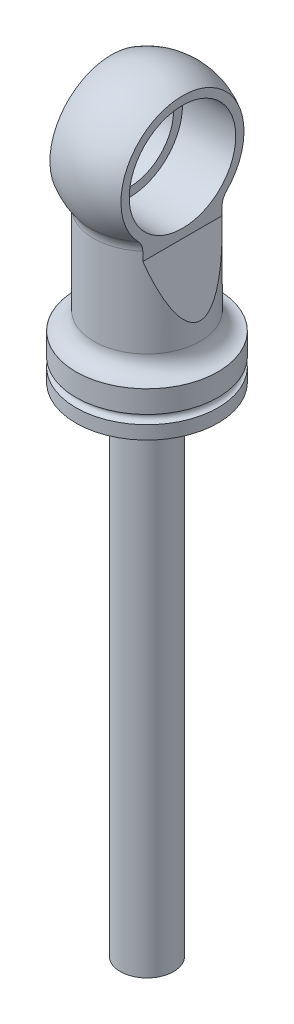
ISO-10303-21;
HEADER;
FILE_DESCRIPTION(('STEP AP214'),'2;1');
FILE_NAME('part.step','',(''),(''),'','','');
FILE_SCHEMA(('AUTOMOTIVE_DESIGN { 1 0 10303 214 1 1 1 1 }'));
ENDSEC;
DATA;
#1=APPLICATION_CONTEXT('core data for automotive mechanical design processes');
#2=APPLICATION_PROTOCOL_DEFINITION('international standard','automotive_design',2000,#1);
#3=PRODUCT_CONTEXT('',#1,'mechanical');
#4=PRODUCT('Part','Part','',(#3));
#5=PRODUCT_RELATED_PRODUCT_CATEGORY('part','',(#4));
#6=PRODUCT_DEFINITION_FORMATION('','',#4);
#7=PRODUCT_DEFINITION_CONTEXT('part definition',#1,'design');
#8=PRODUCT_DEFINITION('design','',#6,#7);
#9=PRODUCT_DEFINITION_SHAPE('','',#8);
#10=(LENGTH_UNIT() NAMED_UNIT(*) SI_UNIT(.MILLI.,.METRE.));
#11=(NAMED_UNIT(*) PLANE_ANGLE_UNIT() SI_UNIT($,.RADIAN.));
#12=(NAMED_UNIT(*) SI_UNIT($,.STERADIAN.) SOLID_ANGLE_UNIT());
#13=UNCERTAINTY_MEASURE_WITH_UNIT(LENGTH_MEASURE(1.E-05),#10,'distance_accuracy_value','');
#14=(GEOMETRIC_REPRESENTATION_CONTEXT(3) GLOBAL_UNCERTAINTY_ASSIGNED_CONTEXT((#13)) GLOBAL_UNIT_ASSIGNED_CONTEXT((#10,
#11,#12)) REPRESENTATION_CONTEXT('',''));
#15=CARTESIAN_POINT('',(0.,0.,0.));
#16=DIRECTION('',(0.,0.,1.));
#17=DIRECTION('',(1.,0.,0.));
#18=AXIS2_PLACEMENT_3D('',#15,#16,#17);
#19=CARTESIAN_POINT('',(-12.7,-36.5125,0.));
#20=DIRECTION('',(0.,-1.,0.));
#21=DIRECTION('',(0.,0.,-1.));
#22=AXIS2_PLACEMENT_3D('',#19,#20,#21);
#23=PLANE('',#22);
#24=CARTESIAN_POINT('',(0.,-36.5125,0.));
#25=DIRECTION('',(0.,1.,0.));
#26=DIRECTION('',(0.,0.,1.));
#27=AXIS2_PLACEMENT_3D('',#24,#25,#26);
#28=CIRCLE('',#27,12.7);
#29=CARTESIAN_POINT('',(0.,-36.5125,12.7));
#30=VERTEX_POINT('',#29);
#31=EDGE_CURVE('E187',#30,#30,#28,.T.);
#32=ORIENTED_EDGE('',*,*,#31,.F.);
#33=EDGE_LOOP('',(#32));
#34=FACE_BOUND('',#33,.T.);
#35=CARTESIAN_POINT('',(0.,-36.5125,0.));
#36=DIRECTION('',(0.,-1.,0.));
#37=DIRECTION('',(0.,0.,-1.));
#38=AXIS2_PLACEMENT_3D('',#35,#36,#37);
#39=CIRCLE('',#38,4.7625);
#40=CARTESIAN_POINT('',(0.,-36.5125,-4.7625));
#41=VERTEX_POINT('',#40);
#42=EDGE_CURVE('E128',#41,#41,#39,.T.);
#43=ORIENTED_EDGE('',*,*,#42,.F.);
#44=EDGE_LOOP('',(#43));
#45=FACE_BOUND('',#44,.T.);
#46=ADVANCED_FACE('F34',(#34,#45),#23,.T.);
#47=CARTESIAN_POINT('',(0.,0.,0.));
#48=DIRECTION('',(0.,1.,0.));
#49=DIRECTION('',(1.,0.,0.));
#50=AXIS2_PLACEMENT_3D('',#47,#48,#49);
#51=SPHERICAL_SURFACE('',#50,12.7);
#52=CARTESIAN_POINT('',(0.,-7.62542433254951,0.));
#53=DIRECTION('',(0.,1.,0.));
#54=DIRECTION('',(0.,0.,1.));
#55=AXIS2_PLACEMENT_3D('',#52,#53,#54);
#56=CIRCLE('',#55,10.1559294871795);
#57=CARTESIAN_POINT('',(6.35,-7.62542433254951,-7.92593235831355));
#58=VERTEX_POINT('',#57);
#59=CARTESIAN_POINT('',(-6.35,-7.62542433254951,-7.92593235831355));
#60=VERTEX_POINT('',#59);
#61=EDGE_CURVE('E186',#58,#60,#56,.T.);
#62=ORIENTED_EDGE('',*,*,#61,.T.);
#63=CARTESIAN_POINT('',(-6.35,0.,0.));
#64=DIRECTION('',(-1.,0.,0.));
#65=DIRECTION('',(0.,-1.,0.));
#66=AXIS2_PLACEMENT_3D('',#63,#64,#65);
#67=CIRCLE('',#66,10.9985226280624);
#68=CARTESIAN_POINT('',(-6.35,-7.62542433254951,7.92593235831355));
#69=VERTEX_POINT('',#68);
#70=EDGE_CURVE('E161',#60,#69,#67,.F.);
#71=ORIENTED_EDGE('',*,*,#70,.T.);
#72=CARTESIAN_POINT('',(6.35,-7.62542433254951,7.92593235831355));
#73=VERTEX_POINT('',#72);
#74=EDGE_CURVE('E183',#69,#73,#56,.T.);
#75=ORIENTED_EDGE('',*,*,#74,.T.);
#76=CARTESIAN_POINT('',(6.35,0.,0.));
#77=DIRECTION('',(1.,0.,0.));
#78=DIRECTION('',(0.,0.,-1.));
#79=AXIS2_PLACEMENT_3D('',#76,#77,#78);
#80=CIRCLE('',#79,10.9985226280624);
#81=EDGE_CURVE('E138',#73,#58,#80,.F.);
#82=ORIENTED_EDGE('',*,*,#81,.T.);
#83=EDGE_LOOP('',(#62,#71,#75,#82));
#84=FACE_BOUND('',#83,.T.);
#85=ADVANCED_FACE('F208',(#84),#51,.T.);
#86=CARTESIAN_POINT('',(0.,-9.5165295670218,0.));
#87=DIRECTION('',(0.,1.,0.));
#88=DIRECTION('',(0.,0.,1.));
#89=AXIS2_PLACEMENT_3D('',#86,#87,#88);
#90=TOROIDAL_SURFACE('',#89,12.6746,3.1496);
#91=CARTESIAN_POINT('',(0.,-9.51652956702179,0.));
#92=DIRECTION('',(0.,1.,0.));
#93=DIRECTION('',(0.,0.,1.));
#94=AXIS2_PLACEMENT_3D('',#91,#92,#93);
#95=CIRCLE('',#94,9.525);
#96=CARTESIAN_POINT('',(6.35,-9.51652956702179,-7.09951582856183));
#97=VERTEX_POINT('',#96);
#98=CARTESIAN_POINT('',(-6.35,-9.51652956702179,-7.09951582856182));
#99=VERTEX_POINT('',#98);
#100=EDGE_CURVE('E107',#97,#99,#95,.T.);
#101=ORIENTED_EDGE('',*,*,#100,.T.);
#102=CARTESIAN_POINT('',(-6.35,-7.84310383005062,-7.73332294756805));
#103=CARTESIAN_POINT('',(-6.35,-7.67425867062039,-7.87033894564403));
#104=CARTESIAN_POINT('',(-6.35,-7.51871969097066,-8.02395964662133));
#105=CARTESIAN_POINT('',(-6.35,-7.23566852278561,-8.35535431437894));
#106=CARTESIAN_POINT('',(-6.35,-7.10823380283425,-8.53319291011566));
#107=CARTESIAN_POINT('',(-6.35,-6.88315677802546,-8.90509723389965));
#108=CARTESIAN_POINT('',(-6.35,-6.78531878962239,-9.09904506653129));
#109=CARTESIAN_POINT('',(-6.35,-6.61931530429697,-9.49905219247618));
#110=CARTESIAN_POINT('',(-6.35,-6.55113262520225,-9.70510439379472));
#111=CARTESIAN_POINT('',(-6.35,-6.43869250593361,-10.1526633563205));
#112=CARTESIAN_POINT('',(-6.35,-6.39876184043421,-10.3952685812136));
#113=CARTESIAN_POINT('',(-6.35,-6.36077099477004,-10.8840806595856));
#114=CARTESIAN_POINT('',(-6.35,-6.36272983671395,-11.1302890985765));
#115=CARTESIAN_POINT('',(-6.35,-6.39846747391305,-11.4943592703766));
#116=CARTESIAN_POINT('',(-6.35,-6.41561648879375,-11.6140283018363));
#117=CARTESIAN_POINT('',(-6.35,-6.46078043382359,-11.851278180977));
#118=CARTESIAN_POINT('',(-6.35,-6.48878973464401,-11.9688600775382));
#119=CARTESIAN_POINT('',(-6.35,-6.55579819941596,-12.2008518022777));
#120=CARTESIAN_POINT('',(-6.35,-6.59479731533022,-12.3152616443188));
#121=CARTESIAN_POINT('',(-6.35,-6.6837823716992,-12.5396642320866));
#122=CARTESIAN_POINT('',(-6.35,-6.73376129473833,-12.6496597462343));
#123=CARTESIAN_POINT('',(-6.35,-6.83883363263572,-12.8528669668754));
#124=CARTESIAN_POINT('',(-6.35,-6.89285382435656,-12.9466341853112));
#125=CARTESIAN_POINT('',(-6.35,-7.00941071773218,-13.1286534181817));
#126=CARTESIAN_POINT('',(-6.35,-7.07194242323563,-13.2169086240897));
#127=CARTESIAN_POINT('',(-6.35,-7.20521925291905,-13.3869457150121));
#128=CARTESIAN_POINT('',(-6.35,-7.27596085196346,-13.4687303531542));
#129=CARTESIAN_POINT('',(-6.35,-7.4251846056352,-13.6248462837713));
#130=CARTESIAN_POINT('',(-6.35,-7.50366569904109,-13.699178595281));
#131=CARTESIAN_POINT('',(-6.35,-7.72980498269956,-13.8923661242834));
#132=CARTESIAN_POINT('',(-6.35,-7.88504037180109,-14.0025812013301));
#133=CARTESIAN_POINT('',(-6.35,-8.21322824809433,-14.1921017588644));
#134=CARTESIAN_POINT('',(-6.35,-8.38616844563738,-14.2714284989655));
#135=CARTESIAN_POINT('',(-6.35,-8.72723211608899,-14.3896417987474));
#136=CARTESIAN_POINT('',(-6.35,-8.8942840219769,-14.4316253339902));
#137=CARTESIAN_POINT('',(-6.35,-9.23316210246508,-14.4853847781045));
#138=CARTESIAN_POINT('',(-6.35,-9.40498657401244,-14.4971713260363));
#139=CARTESIAN_POINT('',(-6.35,-9.73979010026275,-14.4902197096853));
#140=CARTESIAN_POINT('',(-6.35,-9.90280078310935,-14.4729082101622));
#141=CARTESIAN_POINT('',(-6.35,-10.223575810186,-14.4111497530794));
#142=CARTESIAN_POINT('',(-6.35,-10.3813405067455,-14.3667046217588));
#143=CARTESIAN_POINT('',(-6.35,-10.6873924834501,-14.2523693650068));
#144=CARTESIAN_POINT('',(-6.35,-10.835676177723,-14.1824696783838));
#145=CARTESIAN_POINT('',(-6.35,-11.1190594690239,-14.0197646882624));
#146=CARTESIAN_POINT('',(-6.35,-11.254157229335,-13.9269562000492));
#147=CARTESIAN_POINT('',(-6.35,-11.5138382501971,-13.7170233747091));
#148=CARTESIAN_POINT('',(-6.35,-11.6377044936164,-13.5990140054187));
#149=CARTESIAN_POINT('',(-6.35,-11.865616901087,-13.3452408160446));
#150=CARTESIAN_POINT('',(-6.35,-11.9696574824533,-13.2094720131996));
#151=CARTESIAN_POINT('',(-6.35,-12.1639166791956,-12.912708442764));
#152=CARTESIAN_POINT('',(-6.35,-12.2523797487954,-12.7505664072903));
#153=CARTESIAN_POINT('',(-6.35,-12.4037483936718,-12.4147964360184));
#154=CARTESIAN_POINT('',(-6.35,-12.4666437234626,-12.24116392811));
#155=CARTESIAN_POINT('',(-6.35,-12.5721019196781,-11.8681054327515));
#156=CARTESIAN_POINT('',(-6.35,-12.6118439724177,-11.6678830452101));
#157=CARTESIAN_POINT('',(-6.35,-12.6608293614579,-11.2637816645554));
#158=CARTESIAN_POINT('',(-6.35,-12.6700610256672,-11.0599013020247));
#159=CARTESIAN_POINT('',(-6.35,-12.658570685985,-10.6300948730565));
#160=CARTESIAN_POINT('',(-6.35,-12.6343742028499,-10.4042600183243));
#161=CARTESIAN_POINT('',(-6.35,-12.5514619059851,-9.9588968771831));
#162=CARTESIAN_POINT('',(-6.35,-12.4927161316634,-9.7393742381418));
#163=CARTESIAN_POINT('',(-6.35,-12.3360769412069,-9.29407399479931));
#164=CARTESIAN_POINT('',(-6.35,-12.2353367814491,-9.06929176921049));
#165=CARTESIAN_POINT('',(-6.35,-11.9968084378822,-8.6402335273859));
#166=CARTESIAN_POINT('',(-6.35,-11.8590436730055,-8.43594466040554));
#167=CARTESIAN_POINT('',(-6.35,-11.5854662654399,-8.10281956729697));
#168=CARTESIAN_POINT('',(-6.35,-11.4572888413988,-7.96770215490179));
#169=CARTESIAN_POINT('',(-6.35,-11.1810367977786,-7.71966127141118));
#170=CARTESIAN_POINT('',(-6.35,-11.032994420786,-7.60670255132212));
#171=CARTESIAN_POINT('',(-6.35,-10.7501982544391,-7.42953902480605));
#172=CARTESIAN_POINT('',(-6.35,-10.6187629472849,-7.36009772127572));
#173=CARTESIAN_POINT('',(-6.35,-10.4144827079364,-7.27284659949222));
#174=CARTESIAN_POINT('',(-6.35,-10.3451902925217,-7.24657864601216));
#175=CARTESIAN_POINT('',(-6.35,-10.2046026969392,-7.20014476755135));
#176=CARTESIAN_POINT('',(-6.35,-10.1333084074126,-7.17997617451824));
#177=CARTESIAN_POINT('',(-6.35,-9.98866442084933,-7.1460342611665));
#178=CARTESIAN_POINT('',(-6.35,-9.91530359372446,-7.13230820847833));
#179=CARTESIAN_POINT('',(-6.35,-9.76764803242629,-7.11179043791812));
#180=CARTESIAN_POINT('',(-6.35,-9.69335373907065,-7.10499556290679));
#181=CARTESIAN_POINT('',(-6.35,-9.54444615943143,-7.09850101653952));
#182=CARTESIAN_POINT('',(-6.35,-9.46983285702231,-7.09880170819902));
#183=CARTESIAN_POINT('',(-6.35,-9.32099513874454,-7.10648022189505));
#184=CARTESIAN_POINT('',(-6.35,-9.2467706951336,-7.11385753195762));
#185=CARTESIAN_POINT('',(-6.35,-9.04115216977161,-7.14409571355205));
#186=CARTESIAN_POINT('',(-6.35,-8.91081414763654,-7.17457779897771));
#187=CARTESIAN_POINT('',(-6.35,-8.65666920686529,-7.25554526975794));
#188=CARTESIAN_POINT('',(-6.35,-8.53286202660712,-7.30602985313262));
#189=CARTESIAN_POINT('',(-6.35,-8.31165939331874,-7.4152462807729));
#190=CARTESIAN_POINT('',(-6.35,-8.21308146737468,-7.47161910983671));
#191=CARTESIAN_POINT('',(-6.35,-8.02283021626394,-7.59492957590398));
#192=CARTESIAN_POINT('',(-6.35,-7.93115759228673,-7.66186828367458));
#193=CARTESIAN_POINT('',(-6.35,-7.84310383005062,-7.73332294756805));
#194=B_SPLINE_CURVE_WITH_KNOTS('',3,(#102,#103,#104,#105,#106,#107,#108,#109,#110,#111,#112,
#113,#114,#115,#116,#117,#118,#119,#120,#121,#122,#123,#124,#125,#126,#127,#128,#129,#130,#131,
#132,#133,#134,#135,#136,#137,#138,#139,#140,#141,#142,#143,#144,#145,#146,#147,#148,#149,#150,
#151,#152,#153,#154,#155,#156,#157,#158,#159,#160,#161,#162,#163,#164,#165,#166,#167,#168,#169,
#170,#171,#172,#173,#174,#175,#176,#177,#178,#179,#180,#181,#182,#183,#184,#185,#186,#187,#188,
#189,#190,#191,#192,#193),.UNSPECIFIED.,.T.,.F.,(4,2,2,2,2,2,2,2,2,2,2,2,2,2,2,2,2,2,2,2,2,2,2,
2,2,2,2,2,2,2,2,2,2,2,2,2,2,2,2,2,2,2,2,2,2,4),(0.,0.651864859451289,1.30550470971762,
1.95472338650657,2.60356540576687,3.33775454537079,4.07227708880035,4.4345369400414,
4.79660926772265,5.15868001278363,5.52052002089352,5.84471131485161,6.1687131267146,
6.49257633095802,6.81639518941567,7.38413991039908,7.95149317427781,8.46559232957925,
8.9795103315625,9.46895895095895,9.95837463147002,10.4479743353096,10.9376421402449,
11.4486983065834,11.959898168657,12.511723889248,13.063770519573,13.6736582876927,
14.2837793482261,14.9623076336107,15.6414251972884,16.376960097472,17.1120308450905,
17.6687655984671,18.2246074121342,18.6686237320598,18.8906997065647,19.1126783970614,
19.3362611814364,19.5597420787068,19.7832344094817,20.0067105724179,20.4063476269543,
20.805968660069,21.145885619754,21.485837049442),.UNSPECIFIED.);
#195=EDGE_CURVE('E155',#99,#60,#194,.T.);
#196=ORIENTED_EDGE('',*,*,#195,.T.);
#197=ORIENTED_EDGE('',*,*,#61,.F.);
#198=CARTESIAN_POINT('',(6.35,-7.84310383005061,-7.73332294756805));
#199=CARTESIAN_POINT('',(6.35,-7.96173465387693,-7.63705127274386));
#200=CARTESIAN_POINT('',(6.35,-8.08698746997834,-7.5489255738855));
#201=CARTESIAN_POINT('',(6.35,-8.34976264132331,-7.39295397713962));
#202=CARTESIAN_POINT('',(6.35,-8.48727986357563,-7.32509964636888));
#203=CARTESIAN_POINT('',(6.35,-8.7013348120905,-7.24166544782621));
#204=CARTESIAN_POINT('',(6.35,-8.77435183358148,-7.21683779047604));
#205=CARTESIAN_POINT('',(6.35,-8.92234540509025,-7.17399367218673));
#206=CARTESIAN_POINT('',(6.35,-8.99732096345499,-7.15597383311226));
#207=CARTESIAN_POINT('',(6.35,-9.14860759705239,-7.12717720420489));
#208=CARTESIAN_POINT('',(6.35,-9.2249178667636,-7.11639619053273));
#209=CARTESIAN_POINT('',(6.35,-9.378224643217,-7.10233528316837));
#210=CARTESIAN_POINT('',(6.35,-9.45522107310544,-7.09905455974454));
#211=CARTESIAN_POINT('',(6.35,-9.60095295833021,-7.10002682038055));
#212=CARTESIAN_POINT('',(6.35,-9.66969423380486,-7.10351412084244));
#213=CARTESIAN_POINT('',(6.35,-9.80661889642642,-7.1164597488082));
#214=CARTESIAN_POINT('',(6.35,-9.87480209341467,-7.12592003221475));
#215=CARTESIAN_POINT('',(6.35,-10.0777264002238,-7.16301015646336));
#216=CARTESIAN_POINT('',(6.35,-10.210960668012,-7.19935052034599));
#217=CARTESIAN_POINT('',(6.35,-10.4684290545296,-7.29210181101085));
#218=CARTESIAN_POINT('',(6.35,-10.5927446797604,-7.34829226352053));
#219=CARTESIAN_POINT('',(6.35,-10.8321634169357,-7.47767731645014));
#220=CARTESIAN_POINT('',(6.35,-10.9472607160468,-7.55088253417574));
#221=CARTESIAN_POINT('',(6.35,-11.2187406079278,-7.74896032635201));
#222=CARTESIAN_POINT('',(6.35,-11.3692011497289,-7.88197076264031));
#223=CARTESIAN_POINT('',(6.35,-11.6466151153075,-8.17059498679707));
#224=CARTESIAN_POINT('',(6.35,-11.7735287586425,-8.32624624722992));
#225=CARTESIAN_POINT('',(6.35,-12.0049196855766,-8.65696644576974));
#226=CARTESIAN_POINT('',(6.35,-12.1090163263229,-8.83230028239021));
#227=CARTESIAN_POINT('',(6.35,-12.2915167869573,-9.19573237345683));
#228=CARTESIAN_POINT('',(6.35,-12.3699255021381,-9.3838281876236));
#229=CARTESIAN_POINT('',(6.35,-12.5121902486135,-9.80455144181331));
#230=CARTESIAN_POINT('',(6.35,-12.5707060703006,-10.0390000253844));
#231=CARTESIAN_POINT('',(6.35,-12.6484278891894,-10.5146404536703));
#232=CARTESIAN_POINT('',(6.35,-12.6676092273821,-10.7558364323981));
#233=CARTESIAN_POINT('',(6.35,-12.6652397603544,-11.1194098097971));
#234=CARTESIAN_POINT('',(6.35,-12.6590531762719,-11.2420386020347));
#235=CARTESIAN_POINT('',(6.35,-12.6356729243789,-11.4862244058386));
#236=CARTESIAN_POINT('',(6.35,-12.6184844734404,-11.6077818977145));
#237=CARTESIAN_POINT('',(6.35,-12.5728935999821,-11.8487936385444));
#238=CARTESIAN_POINT('',(6.35,-12.5444897902073,-11.9682476254007));
#239=CARTESIAN_POINT('',(6.35,-12.4763589047653,-12.2038227022824));
#240=CARTESIAN_POINT('',(6.35,-12.4366387976272,-12.3199457951696));
#241=CARTESIAN_POINT('',(6.35,-12.3498734606873,-12.5375884727488));
#242=CARTESIAN_POINT('',(6.35,-12.3037878262173,-12.6394908698819));
#243=CARTESIAN_POINT('',(6.35,-12.2023007087685,-12.8384897755395));
#244=CARTESIAN_POINT('',(6.35,-12.1469045146815,-12.9355889722315));
#245=CARTESIAN_POINT('',(6.35,-12.027006248514,-13.1239460753542));
#246=CARTESIAN_POINT('',(6.35,-11.962508003888,-13.2152064137277));
#247=CARTESIAN_POINT('',(6.35,-11.8247299517476,-13.3908397340431));
#248=CARTESIAN_POINT('',(6.35,-11.7514514369541,-13.4752137267952));
#249=CARTESIAN_POINT('',(6.35,-11.6061830184725,-13.62604832263));
#250=CARTESIAN_POINT('',(6.35,-11.535152179626,-13.6934342409515));
#251=CARTESIAN_POINT('',(6.35,-11.3871753608624,-13.8213550776947));
#252=CARTESIAN_POINT('',(6.35,-11.3102302443966,-13.8818909929999));
#253=CARTESIAN_POINT('',(6.35,-11.1509972054128,-13.99539539611));
#254=CARTESIAN_POINT('',(6.35,-11.0687122980499,-14.0483681013829));
#255=CARTESIAN_POINT('',(6.35,-10.8994542660832,-14.1461318308986));
#256=CARTESIAN_POINT('',(6.35,-10.812481568403,-14.1909235985658));
#257=CARTESIAN_POINT('',(6.35,-10.5640668499739,-14.303755048518));
#258=CARTESIAN_POINT('',(6.35,-10.3981128339992,-14.3621765230509));
#259=CARTESIAN_POINT('',(6.35,-10.0585306771137,-14.4482790651336));
#260=CARTESIAN_POINT('',(6.35,-9.88490590842134,-14.4759735037987));
#261=CARTESIAN_POINT('',(6.35,-9.54599478425526,-14.4987727421984));
#262=CARTESIAN_POINT('',(6.35,-9.38083195409557,-14.4957303611682));
#263=CARTESIAN_POINT('',(6.35,-9.05345647930766,-14.4615941516994));
#264=CARTESIAN_POINT('',(6.35,-8.89124344898266,-14.4305040179021));
#265=CARTESIAN_POINT('',(6.35,-8.57620005322163,-14.3420341105881));
#266=CARTESIAN_POINT('',(6.35,-8.42328333426046,-14.2849603285418));
#267=CARTESIAN_POINT('',(6.35,-8.12877219969566,-14.1467500063917));
#268=CARTESIAN_POINT('',(6.35,-7.98717884207478,-14.0656112211346));
#269=CARTESIAN_POINT('',(6.35,-7.71408259131937,-13.8790056033043));
#270=CARTESIAN_POINT('',(6.35,-7.58307339078563,-13.7728179727529));
#271=CARTESIAN_POINT('',(6.35,-7.33928964366907,-13.5412905647295));
#272=CARTESIAN_POINT('',(6.35,-7.22651966167471,-13.4159460082193));
#273=CARTESIAN_POINT('',(6.35,-7.01368607463211,-13.1403364616503));
#274=CARTESIAN_POINT('',(6.35,-6.91510033759034,-12.9889321967373));
#275=CARTESIAN_POINT('',(6.35,-6.74210870186688,-12.6729248445796));
#276=CARTESIAN_POINT('',(6.35,-6.66771188779961,-12.5083168272811));
#277=CARTESIAN_POINT('',(6.35,-6.53727634166523,-12.1532456520108));
#278=CARTESIAN_POINT('',(6.35,-6.48380545062872,-11.9618405418493));
#279=CARTESIAN_POINT('',(6.35,-6.4061926733504,-11.5732160036125));
#280=CARTESIAN_POINT('',(6.35,-6.38206188526499,-11.3759944042721));
#281=CARTESIAN_POINT('',(6.35,-6.36111286461461,-10.9578215404143));
#282=CARTESIAN_POINT('',(6.35,-6.36767797229506,-10.7367001036586));
#283=CARTESIAN_POINT('',(6.35,-6.41440295057409,-10.2979563384799));
#284=CARTESIAN_POINT('',(6.35,-6.45458946132352,-10.0803369243182));
#285=CARTESIAN_POINT('',(6.35,-6.57234527848567,-9.63299893044046));
#286=CARTESIAN_POINT('',(6.35,-6.65313148047699,-9.404122917239));
#287=CARTESIAN_POINT('',(6.35,-6.85135689620234,-8.96281456584061));
#288=CARTESIAN_POINT('',(6.35,-6.96877826079984,-8.75037428270609));
#289=CARTESIAN_POINT('',(6.35,-7.20684595467387,-8.39697721832089));
#290=CARTESIAN_POINT('',(6.35,-7.32011069959347,-8.25102225551854));
#291=CARTESIAN_POINT('',(6.35,-7.56676052491725,-7.97722175840516));
#292=CARTESIAN_POINT('',(6.35,-7.70012242529937,-7.84935568560474));
#293=CARTESIAN_POINT('',(6.35,-7.84310383005061,-7.73332294756805));
#294=B_SPLINE_CURVE_WITH_KNOTS('',3,(#198,#199,#200,#201,#202,#203,#204,#205,#206,#207,#208,
#209,#210,#211,#212,#213,#214,#215,#216,#217,#218,#219,#220,#221,#222,#223,#224,#225,#226,#227,
#228,#229,#230,#231,#232,#233,#234,#235,#236,#237,#238,#239,#240,#241,#242,#243,#244,#245,#246,
#247,#248,#249,#250,#251,#252,#253,#254,#255,#256,#257,#258,#259,#260,#261,#262,#263,#264,#265,
#266,#267,#268,#269,#270,#271,#272,#273,#274,#275,#276,#277,#278,#279,#280,#281,#282,#283,#284,
#285,#286,#287,#288,#289,#290,#291,#292,#293),.UNSPECIFIED.,.T.,.F.,(4,2,2,2,2,2,2,2,2,2,2,2,2,
2,2,2,2,2,2,2,2,2,2,2,2,2,2,2,2,2,2,2,2,2,2,2,2,2,2,2,2,2,2,2,2,2,2,4),(0.,0.457932847566754,
0.915674929083266,1.14677137273797,1.37775299199254,1.6085997165653,1.83942090211308,
2.04564090348397,2.25192846834815,2.66415301371522,3.07193594203399,3.47997401552969,
4.07918556393307,4.6794003894963,5.28897287993639,5.89842913779469,6.6201363751071,
7.34229591660277,7.71023792492107,8.07800559138959,8.44581876219248,8.81340592292038,
9.14845588018183,9.48331615060722,9.81803602800762,10.1527066849493,10.4460346460267,
10.7393198639183,11.0324408932099,11.3255352725207,11.8503561552977,12.3749485683904,
12.8681166811104,13.3612198398441,13.8486605486523,14.3361467477337,14.8398829318753,
15.3437449877678,15.8835081744472,16.4234738460164,17.0172420311337,17.6112347445758,
18.2721472779619,18.9335839864683,19.6584853137044,20.3830340094884,20.9355962811987,
21.4875260387016),.UNSPECIFIED.);
#295=EDGE_CURVE('E151',#58,#97,#294,.T.);
#296=ORIENTED_EDGE('',*,*,#295,.T.);
#297=EDGE_LOOP('',(#101,#196,#197,#296));
#298=FACE_BOUND('',#297,.T.);
#299=ADVANCED_FACE('F140',(#298),#90,.F.);
#300=ORIENTED_EDGE('',*,*,#74,.F.);
#301=CARTESIAN_POINT('',(-6.35,-8.87023538573726,7.189186032031));
#302=CARTESIAN_POINT('',(-6.35,-9.00247354573818,7.15219818431826));
#303=CARTESIAN_POINT('',(-6.35,-9.13780600886833,7.12613127471773));
#304=CARTESIAN_POINT('',(-6.35,-9.41094957477495,7.09790553975814));
#305=CARTESIAN_POINT('',(-6.35,-9.5487598825622,7.09573917858346));
#306=CARTESIAN_POINT('',(-6.35,-9.82252511850843,7.11548139444599));
#307=CARTESIAN_POINT('',(-6.35,-9.9584811461101,7.13737501610435));
#308=CARTESIAN_POINT('',(-6.35,-10.2248414690528,7.20343980276355));
#309=CARTESIAN_POINT('',(-6.35,-10.3552429404311,7.24762215626165));
#310=CARTESIAN_POINT('',(-6.35,-10.6092731611062,7.35596648643781));
#311=CARTESIAN_POINT('',(-6.35,-10.7327975970533,7.42036994714288));
#312=CARTESIAN_POINT('',(-6.35,-10.9697002135338,7.56564075288224));
#313=CARTESIAN_POINT('',(-6.35,-11.0830719969379,7.64651837456426));
#314=CARTESIAN_POINT('',(-6.35,-11.3522505988251,7.86512918839198));
#315=CARTESIAN_POINT('',(-6.35,-11.5013143360905,8.01119898252456));
#316=CARTESIAN_POINT('',(-6.35,-11.7738172494592,8.3255711081996));
#317=CARTESIAN_POINT('',(-6.35,-11.8972133983457,8.49391000958935));
#318=CARTESIAN_POINT('',(-6.35,-12.1191985196684,8.84949675045957));
#319=CARTESIAN_POINT('',(-6.35,-12.2174093295746,9.03697966122257));
#320=CARTESIAN_POINT('',(-6.35,-12.3858060597251,9.42401938591865));
#321=CARTESIAN_POINT('',(-6.35,-12.4559974736342,9.62357382418538));
#322=CARTESIAN_POINT('',(-6.35,-12.5759923167075,10.0627287639551));
#323=CARTESIAN_POINT('',(-6.35,-12.6208567029117,10.3036934203536));
#324=CARTESIAN_POINT('',(-6.35,-12.6692719713926,10.7900672495449));
#325=CARTESIAN_POINT('',(-6.35,-12.6728033541893,11.0354784653967));
#326=CARTESIAN_POINT('',(-6.35,-12.6455724973707,11.400089796904));
#327=CARTESIAN_POINT('',(-6.35,-12.6311671470388,11.5206802240225));
#328=CARTESIAN_POINT('',(-6.35,-12.591433805859,11.7600285724059));
#329=CARTESIAN_POINT('',(-6.35,-12.5661113572989,11.8787873918796));
#330=CARTESIAN_POINT('',(-6.35,-12.5043965922108,12.1133992092848));
#331=CARTESIAN_POINT('',(-6.35,-12.4680039838868,12.2292521305333));
#332=CARTESIAN_POINT('',(-6.35,-12.3841221163797,12.456807675505));
#333=CARTESIAN_POINT('',(-6.35,-12.3366398885766,12.5685128772931));
#334=CARTESIAN_POINT('',(-6.35,-12.2359832177488,12.7755912306391));
#335=CARTESIAN_POINT('',(-6.35,-12.1838620673226,12.8714768418373));
#336=CARTESIAN_POINT('',(-6.35,-12.0708940228392,13.0578994784104));
#337=CARTESIAN_POINT('',(-6.35,-12.0100522315174,13.1484395881755));
#338=CARTESIAN_POINT('',(-6.35,-11.8799202665866,13.3231941070291));
#339=CARTESIAN_POINT('',(-6.35,-11.81063370275,13.4074111942296));
#340=CARTESIAN_POINT('',(-6.35,-11.6640607167506,13.5685129048108));
#341=CARTESIAN_POINT('',(-6.35,-11.5867754151252,13.6453985523561));
#342=CARTESIAN_POINT('',(-6.35,-11.3636374199426,13.8456596210461));
#343=CARTESIAN_POINT('',(-6.35,-11.2099311027941,13.9605105423814));
#344=CARTESIAN_POINT('',(-6.35,-10.8838620130338,14.1594074132313));
#345=CARTESIAN_POINT('',(-6.35,-10.7115125944397,14.2434752258134));
#346=CARTESIAN_POINT('',(-6.35,-10.371119543807,14.3704165179264));
#347=CARTESIAN_POINT('',(-6.35,-10.2042641842747,14.4164813722772));
#348=CARTESIAN_POINT('',(-6.35,-9.86504376119722,14.4782681143358));
#349=CARTESIAN_POINT('',(-6.35,-9.69268077449356,14.4940013055318));
#350=CARTESIAN_POINT('',(-6.35,-9.35670074989675,14.494449124097));
#351=CARTESIAN_POINT('',(-6.35,-9.19308359202679,14.4806967666458));
#352=CARTESIAN_POINT('',(-6.35,-8.87052765044576,14.4258193631396));
#353=CARTESIAN_POINT('',(-6.35,-8.71158847877842,14.3846965936936));
#354=CARTESIAN_POINT('',(-6.35,-8.40316229210388,14.276817894716));
#355=CARTESIAN_POINT('',(-6.35,-8.25365186147342,14.2101286330733));
#356=CARTESIAN_POINT('',(-6.35,-7.96735306455507,14.0535471010929));
#357=CARTESIAN_POINT('',(-6.35,-7.83056632917444,13.9636518618018));
#358=CARTESIAN_POINT('',(-6.35,-7.56738707349065,13.7595562419862));
#359=CARTESIAN_POINT('',(-6.35,-7.44165306907643,13.6445085750177));
#360=CARTESIAN_POINT('',(-6.35,-7.20961032349536,13.3962994816641));
#361=CARTESIAN_POINT('',(-6.35,-7.10330690646404,13.2631331079931));
#362=CARTESIAN_POINT('',(-6.35,-6.90422099818023,12.9716516771781));
#363=CARTESIAN_POINT('',(-6.35,-6.81312356904216,12.8121876224086));
#364=CARTESIAN_POINT('',(-6.35,-6.65614329947488,12.481332517592));
#365=CARTESIAN_POINT('',(-6.35,-6.59027038045754,12.3099368057943));
#366=CARTESIAN_POINT('',(-6.35,-6.47833820615585,11.9413162507314));
#367=CARTESIAN_POINT('',(-6.35,-6.43503768706792,11.7432548119521));
#368=CARTESIAN_POINT('',(-6.35,-6.37864501137139,11.3429163294067));
#369=CARTESIAN_POINT('',(-6.35,-6.365564633066,11.1406376729616));
#370=CARTESIAN_POINT('',(-6.35,-6.36868495909835,10.7135419600244));
#371=CARTESIAN_POINT('',(-6.35,-6.38834441212789,10.4887487658428));
#372=CARTESIAN_POINT('',(-6.35,-6.46195594719664,10.0447496407323));
#373=CARTESIAN_POINT('',(-6.35,-6.51593565709142,9.82554835930475));
#374=CARTESIAN_POINT('',(-6.35,-6.66265865392528,9.37928698282207));
#375=CARTESIAN_POINT('',(-6.35,-6.75835638769659,9.15319262976326));
#376=CARTESIAN_POINT('',(-6.35,-6.98673961491046,8.72040363936931));
#377=CARTESIAN_POINT('',(-6.35,-7.11941029832611,8.51370127852448));
#378=CARTESIAN_POINT('',(-6.35,-7.38672969666157,8.17146799384483));
#379=CARTESIAN_POINT('',(-6.35,-7.51426663130184,8.03037029537902));
#380=CARTESIAN_POINT('',(-6.35,-7.79024583373399,7.77040120364876));
#381=CARTESIAN_POINT('',(-6.35,-7.93864983909231,7.65149003696812));
#382=CARTESIAN_POINT('',(-6.35,-8.21578956960332,7.46857829509203));
#383=CARTESIAN_POINT('',(-6.35,-8.34035736692583,7.39826748574173));
#384=CARTESIAN_POINT('',(-6.35,-8.59892146368417,7.2777849884079));
#385=CARTESIAN_POINT('',(-6.35,-8.73290994366654,7.22759682463701));
#386=CARTESIAN_POINT('',(-6.35,-8.87023538573726,7.189186032031));
#387=B_SPLINE_CURVE_WITH_KNOTS('',3,(#301,#302,#303,#304,#305,#306,#307,#308,#309,#310,#311,
#312,#313,#314,#315,#316,#317,#318,#319,#320,#321,#322,#323,#324,#325,#326,#327,#328,#329,#330,
#331,#332,#333,#334,#335,#336,#337,#338,#339,#340,#341,#342,#343,#344,#345,#346,#347,#348,#349,
#350,#351,#352,#353,#354,#355,#356,#357,#358,#359,#360,#361,#362,#363,#364,#365,#366,#367,#368,
#369,#370,#371,#372,#373,#374,#375,#376,#377,#378,#379,#380,#381,#382,#383,#384,#385,#386),
.UNSPECIFIED.,.T.,.F.,(4,2,2,2,2,2,2,2,2,2,2,2,2,2,2,2,2,2,2,2,2,2,2,2,2,2,2,2,2,2,2,2,2,2,2,2,
2,2,2,2,2,2,4),(0.,0.411465279958264,0.822800821674858,1.23388082700297,1.64516739190664,
2.06156545812139,2.47822407500827,3.10094653554772,3.72470461514304,4.35734250697351,
4.98985629871156,5.7217937016012,6.45407639330863,6.81800495860227,7.18174898528577,
7.54550260065315,7.90902620097182,8.2359765014062,8.56273626753222,8.88935684475075,
9.21593172770368,9.7881176914744,10.3598964801072,10.8765219200956,11.3929547956612,
11.8831902018155,12.373384836391,12.8623098261095,13.3512973995079,13.8603880594595,
14.3696180058696,14.918291294452,15.467180168426,16.0729180051883,16.6788918885409,
17.3530205021094,18.0276924784533,18.7608448458551,19.4937039599964,20.0622616787529,
20.6297901495334,21.0574356090702,21.4847302074421),.UNSPECIFIED.);
#388=CARTESIAN_POINT('',(-6.35,-9.51652956702109,7.09951582856151));
#389=VERTEX_POINT('',#388);
#390=EDGE_CURVE('E172',#69,#389,#387,.T.);
#391=ORIENTED_EDGE('',*,*,#390,.T.);
#392=CARTESIAN_POINT('',(6.35,-9.51652956702179,7.09951582856183));
#393=VERTEX_POINT('',#392);
#394=EDGE_CURVE('E180',#389,#393,#95,.T.);
#395=ORIENTED_EDGE('',*,*,#394,.T.);
#396=CARTESIAN_POINT('',(6.35,-8.87023538573726,7.18918603203099));
#397=CARTESIAN_POINT('',(6.35,-8.78837862324269,7.21208490182814));
#398=CARTESIAN_POINT('',(6.35,-8.7076886890659,7.2391594064532));
#399=CARTESIAN_POINT('',(6.35,-8.5492775969765,7.30096399987309));
#400=CARTESIAN_POINT('',(6.35,-8.47155836573555,7.33569896128503));
#401=CARTESIAN_POINT('',(6.35,-8.24326740447953,7.45045095572762));
#402=CARTESIAN_POINT('',(6.35,-8.09785783256199,7.54092842226066));
#403=CARTESIAN_POINT('',(6.35,-7.82487778406611,7.74253626425946));
#404=CARTESIAN_POINT('',(6.35,-7.6971383633086,7.8534433628235));
#405=CARTESIAN_POINT('',(6.35,-7.45844602406392,8.09179781319577));
#406=CARTESIAN_POINT('',(6.35,-7.34748439728504,8.21923652023));
#407=CARTESIAN_POINT('',(6.35,-7.12313931951136,8.51261813416968));
#408=CARTESIAN_POINT('',(6.35,-7.01330834211574,8.68127457467678));
#409=CARTESIAN_POINT('',(6.35,-6.81837133258292,9.03237883966922));
#410=CARTESIAN_POINT('',(6.35,-6.73328676394395,9.21483846438903));
#411=CARTESIAN_POINT('',(6.35,-6.57559025900588,9.62374006032212));
#412=CARTESIAN_POINT('',(6.35,-6.50805049370246,9.85215136644331));
#413=CARTESIAN_POINT('',(6.35,-6.41060410359998,10.3171003374145));
#414=CARTESIAN_POINT('',(6.35,-6.38071401813032,10.5536415268444));
#415=CARTESIAN_POINT('',(6.35,-6.36549356062285,10.9140948211658));
#416=CARTESIAN_POINT('',(6.35,-6.36565612927988,11.0375331573587));
#417=CARTESIAN_POINT('',(6.35,-6.37697029290425,11.2838884040884));
#418=CARTESIAN_POINT('',(6.35,-6.38811697753148,11.4068055229716));
#419=CARTESIAN_POINT('',(6.35,-6.42164072881446,11.6511325914544));
#420=CARTESIAN_POINT('',(6.35,-6.44402062718017,11.7725421531115));
#421=CARTESIAN_POINT('',(6.35,-6.50017312456878,12.0126401154205));
#422=CARTESIAN_POINT('',(6.35,-6.53393892097753,12.1313300957988));
#423=CARTESIAN_POINT('',(6.35,-6.60986634889967,12.3557300114793));
#424=CARTESIAN_POINT('',(6.35,-6.65116879483131,12.4617307337784));
#425=CARTESIAN_POINT('',(6.35,-6.74348020177705,12.669363141635));
#426=CARTESIAN_POINT('',(6.35,-6.79448374498268,12.7709972271906));
#427=CARTESIAN_POINT('',(6.35,-6.90604884482121,12.968833533475));
#428=CARTESIAN_POINT('',(6.35,-6.96660653061669,13.0650379326884));
#429=CARTESIAN_POINT('',(6.35,-7.09701713857868,13.2509271571342));
#430=CARTESIAN_POINT('',(6.35,-7.16686866121398,13.3406129608444));
#431=CARTESIAN_POINT('',(6.35,-7.3063092574581,13.5017784047671));
#432=CARTESIAN_POINT('',(6.35,-7.37487875382662,13.5741416628279));
#433=CARTESIAN_POINT('',(6.35,-7.51842685098732,13.7121956626932));
#434=CARTESIAN_POINT('',(6.35,-7.59340447708365,13.7778874159393));
#435=CARTESIAN_POINT('',(6.35,-7.74922859569889,13.9018202505722));
#436=CARTESIAN_POINT('',(6.35,-7.83007162125839,13.9600656780403));
#437=CARTESIAN_POINT('',(6.35,-7.99699552989619,14.0684259004821));
#438=CARTESIAN_POINT('',(6.35,-8.08307588735123,14.1185415095267));
#439=CARTESIAN_POINT('',(6.35,-8.32894627110173,14.2457738882315));
#440=CARTESIAN_POINT('',(6.35,-8.4937940346891,14.3134067448264));
#441=CARTESIAN_POINT('',(6.35,-8.83288492521527,14.4177416101679));
#442=CARTESIAN_POINT('',(6.35,-9.00712349533293,14.4544584794282));
#443=CARTESIAN_POINT('',(6.35,-9.34764150560586,14.4940298712046));
#444=CARTESIAN_POINT('',(6.35,-9.51367932525715,14.4989745847873));
#445=CARTESIAN_POINT('',(6.35,-9.84412348134594,14.4803472940612));
#446=CARTESIAN_POINT('',(6.35,-10.0085300899129,14.4567801297723));
#447=CARTESIAN_POINT('',(6.35,-10.3280120125974,14.3827763396135));
#448=CARTESIAN_POINT('',(6.35,-10.4832022608186,14.3328329439784));
#449=CARTESIAN_POINT('',(6.35,-10.7833153858351,14.2082756255352));
#450=CARTESIAN_POINT('',(6.35,-10.9282375722611,14.1336600458098));
#451=CARTESIAN_POINT('',(6.35,-11.2081676246387,13.9600265759766));
#452=CARTESIAN_POINT('',(6.35,-11.3427933324799,13.8603941446913));
#453=CARTESIAN_POINT('',(6.35,-11.5947009255434,13.6412420383265));
#454=CARTESIAN_POINT('',(6.35,-11.7119787770782,13.5217177517202));
#455=CARTESIAN_POINT('',(6.35,-11.9343533909241,13.2579061746817));
#456=CARTESIAN_POINT('',(6.35,-12.0381211089981,13.1125005927617));
#457=CARTESIAN_POINT('',(6.35,-12.2222487038727,12.807595361093));
#458=CARTESIAN_POINT('',(6.35,-12.3026004105799,12.6480908173061));
#459=CARTESIAN_POINT('',(6.35,-12.4459283929549,12.3032789272125));
#460=CARTESIAN_POINT('',(6.35,-12.5064829854613,12.1169664580419));
#461=CARTESIAN_POINT('',(6.35,-12.5989313394429,11.7373887284499));
#462=CARTESIAN_POINT('',(6.35,-12.6308120706041,11.5441203484894));
#463=CARTESIAN_POINT('',(6.35,-12.6686630190164,11.133154515441));
#464=CARTESIAN_POINT('',(6.35,-12.6713201805099,10.9151517574319));
#465=CARTESIAN_POINT('',(6.35,-12.643564931589,10.4812864710099));
#466=CARTESIAN_POINT('',(6.35,-12.6131410270759,10.2654247127975));
#467=CARTESIAN_POINT('',(6.35,-12.5161754109911,9.81919621095054));
#468=CARTESIAN_POINT('',(6.35,-12.4463143706518,9.58954887523331));
#469=CARTESIAN_POINT('',(6.35,-12.2701278979063,9.14415257836927));
#470=CARTESIAN_POINT('',(6.35,-12.1637507106094,8.92842386264825));
#471=CARTESIAN_POINT('',(6.35,-11.9760654028802,8.61763562198922));
#472=CARTESIAN_POINT('',(6.35,-11.9075497776375,8.51471523063273));
#473=CARTESIAN_POINT('',(6.35,-11.7613518232432,8.31561788496988));
#474=CARTESIAN_POINT('',(6.35,-11.6836674777032,8.21944242145225));
#475=CARTESIAN_POINT('',(6.35,-11.4373565048275,7.94344030850857));
#476=CARTESIAN_POINT('',(6.35,-11.2549345591944,7.7752287921631));
#477=CARTESIAN_POINT('',(6.35,-10.9322641081301,7.54002811321747));
#478=CARTESIAN_POINT('',(6.35,-10.8022174866572,7.45883292526756));
#479=CARTESIAN_POINT('',(6.35,-10.5305560240586,7.3184223653804));
#480=CARTESIAN_POINT('',(6.35,-10.38895234316,7.25918608790553));
#481=CARTESIAN_POINT('',(6.35,-10.1697450288295,7.1899047622627));
#482=CARTESIAN_POINT('',(6.35,-10.0951510691822,7.17002358798833));
#483=CARTESIAN_POINT('',(6.35,-9.94442977183922,7.1374090092941));
#484=CARTESIAN_POINT('',(6.35,-9.86830326066427,7.12467185363023));
#485=CARTESIAN_POINT('',(6.35,-9.71525805411644,7.10667830530362));
#486=CARTESIAN_POINT('',(6.35,-9.63834034700861,7.10141350741005));
#487=CARTESIAN_POINT('',(6.35,-9.48439147805411,7.09847451175752));
#488=CARTESIAN_POINT('',(6.35,-9.40736037881182,7.10079706806167));
#489=CARTESIAN_POINT('',(6.35,-9.2527873601282,7.11305324021975));
#490=CARTESIAN_POINT('',(6.35,-9.17525414414558,7.1230963532352));
#491=CARTESIAN_POINT('',(6.35,-9.02156470553275,7.15064951302659));
#492=CARTESIAN_POINT('',(6.35,-8.94540802039666,7.1681570013081));
#493=CARTESIAN_POINT('',(6.35,-8.87023538573726,7.18918603203099));
#494=B_SPLINE_CURVE_WITH_KNOTS('',3,(#396,#397,#398,#399,#400,#401,#402,#403,#404,#405,#406,
#407,#408,#409,#410,#411,#412,#413,#414,#415,#416,#417,#418,#419,#420,#421,#422,#423,#424,#425,
#426,#427,#428,#429,#430,#431,#432,#433,#434,#435,#436,#437,#438,#439,#440,#441,#442,#443,#444,
#445,#446,#447,#448,#449,#450,#451,#452,#453,#454,#455,#456,#457,#458,#459,#460,#461,#462,#463,
#464,#465,#466,#467,#468,#469,#470,#471,#472,#473,#474,#475,#476,#477,#478,#479,#480,#481,#482,
#483,#484,#485,#486,#487,#488,#489,#490,#491,#492,#493),.UNSPECIFIED.,.T.,.F.,(4,2,2,2,2,2,2,2,
2,2,2,2,2,2,2,2,2,2,2,2,2,2,2,2,2,2,2,2,2,2,2,2,2,2,2,2,2,2,2,2,2,2,2,2,2,2,2,2,4),(0.,
0.25489452119603,0.509951644189918,1.02097522686048,1.52671363751089,2.03218864354972,
2.6337916847606,3.23591497357481,3.94740015358323,4.65919777684409,5.0291048224428,
5.39884657974867,5.76868158976586,6.13829602865691,6.47911086318259,6.8197359174694,
7.1602233210734,7.50065950960138,7.79932125730453,8.09793765822765,8.39637896683882,
8.6947903728655,9.22628001315414,9.75751403407198,10.2534078633413,10.7492175242069,
11.2360678365713,11.7229508511338,12.2232208861167,12.723607060618,13.2572755770339,
13.7911300736982,14.3764479231492,14.9620316254437,15.6133984731366,16.2649917122006,
16.9820001087039,17.7000289569199,18.0704725927199,18.4409978489638,19.1789260778333,
19.6373151041347,20.0952666027783,20.3265726571711,20.5577571413707,20.78868137262,
21.0195068253908,21.2536677765303,21.4877485309435),.UNSPECIFIED.);
#495=EDGE_CURVE('E58',#393,#73,#494,.T.);
#496=ORIENTED_EDGE('',*,*,#495,.T.);
#497=EDGE_LOOP('',(#300,#391,#395,#496));
#498=FACE_BOUND('',#497,.T.);
#499=ADVANCED_FACE('F203',(#498),#90,.F.);
#500=CARTESIAN_POINT('',(0.,29.568581120514,0.));
#501=DIRECTION('',(0.,1.,0.));
#502=DIRECTION('',(0.,0.,1.));
#503=AXIS2_PLACEMENT_3D('',#500,#501,#502);
#504=CYLINDRICAL_SURFACE('',#503,9.525);
#505=CARTESIAN_POINT('',(0.,-25.4254,0.));
#506=DIRECTION('',(0.,1.,0.));
#507=DIRECTION('',(0.,0.,1.));
#508=AXIS2_PLACEMENT_3D('',#505,#506,#507);
#509=CIRCLE('',#508,9.525);
#510=CARTESIAN_POINT('',(0.,-25.4254,9.525));
#511=VERTEX_POINT('',#510);
#512=EDGE_CURVE('E177',#511,#511,#509,.T.);
#513=ORIENTED_EDGE('',*,*,#512,.T.);
#514=EDGE_LOOP('',(#513));
#515=FACE_BOUND('',#514,.T.);
#516=ORIENTED_EDGE('',*,*,#394,.F.);
#517=DIRECTION('',(0.,1.,0.));
#518=VECTOR('',#517,1.);
#519=CARTESIAN_POINT('',(-6.35,29.568581120514,7.09951582856182));
#520=LINE('',#519,#518);
#521=CARTESIAN_POINT('',(-6.35,-11.1125,7.09951582856183));
#522=VERTEX_POINT('',#521);
#523=EDGE_CURVE('E11',#389,#522,#520,.F.);
#524=ORIENTED_EDGE('',*,*,#523,.T.);
#525=CARTESIAN_POINT('',(0.,11.1125,0.));
#526=DIRECTION('',(-0.961523947640823,0.274721127897378,0.));
#527=DIRECTION('',(0.274721127897378,0.961523947640823,0.));
#528=AXIS2_PLACEMENT_3D('',#525,#526,#527);
#529=ELLIPSE('',#528,34.6715233476984,9.525);
#530=CARTESIAN_POINT('',(-6.35,-11.1125,-7.09951582856183));
#531=VERTEX_POINT('',#530);
#532=EDGE_CURVE('E108',#522,#531,#529,.F.);
#533=ORIENTED_EDGE('',*,*,#532,.T.);
#534=DIRECTION('',(0.,1.,0.));
#535=VECTOR('',#534,1.);
#536=CARTESIAN_POINT('',(-6.35,29.568581120514,-7.09951582856182));
#537=LINE('',#536,#535);
#538=EDGE_CURVE('E43',#531,#99,#537,.T.);
#539=ORIENTED_EDGE('',*,*,#538,.T.);
#540=ORIENTED_EDGE('',*,*,#100,.F.);
#541=DIRECTION('',(0.,1.,0.));
#542=VECTOR('',#541,1.);
#543=CARTESIAN_POINT('',(6.35,29.568581120514,-7.09951582856183));
#544=LINE('',#543,#542);
#545=CARTESIAN_POINT('',(6.35,-11.1125,-7.09951582856183));
#546=VERTEX_POINT('',#545);
#547=EDGE_CURVE('E95',#97,#546,#544,.F.);
#548=ORIENTED_EDGE('',*,*,#547,.T.);
#549=CARTESIAN_POINT('',(0.,11.1125,0.));
#550=DIRECTION('',(-0.961523947640823,-0.274721127897378,0.));
#551=DIRECTION('',(-0.274721127897378,0.961523947640823,0.));
#552=AXIS2_PLACEMENT_3D('',#549,#550,#551);
#553=ELLIPSE('',#552,34.6715233476984,9.525);
#554=CARTESIAN_POINT('',(6.35,-11.1125,7.09951582856183));
#555=VERTEX_POINT('',#554);
#556=EDGE_CURVE('E89',#555,#546,#553,.F.);
#557=ORIENTED_EDGE('',*,*,#556,.F.);
#558=DIRECTION('',(0.,1.,0.));
#559=VECTOR('',#558,1.);
#560=CARTESIAN_POINT('',(6.35,29.568581120514,7.09951582856183));
#561=LINE('',#560,#559);
#562=EDGE_CURVE('E96',#555,#393,#561,.T.);
#563=ORIENTED_EDGE('',*,*,#562,.T.);
#564=EDGE_LOOP('',(#516,#524,#533,#539,#540,#548,#557,#563));
#565=FACE_BOUND('',#564,.T.);
#566=ADVANCED_FACE('F104',(#515,#565),#504,.T.);
#567=CARTESIAN_POINT('',(0.,-25.4254,0.));
#568=DIRECTION('',(0.,1.,0.));
#569=DIRECTION('',(0.,0.,1.));
#570=AXIS2_PLACEMENT_3D('',#567,#568,#569);
#571=TOROIDAL_SURFACE('',#570,12.6746,3.1496);
#572=CARTESIAN_POINT('',(0.,-28.575,0.));
#573=DIRECTION('',(0.,1.,0.));
#574=DIRECTION('',(0.,0.,1.));
#575=AXIS2_PLACEMENT_3D('',#572,#573,#574);
#576=CIRCLE('',#575,12.6746);
#577=CARTESIAN_POINT('',(0.,-28.575,12.6746));
#578=VERTEX_POINT('',#577);
#579=EDGE_CURVE('E199',#578,#578,#576,.T.);
#580=ORIENTED_EDGE('',*,*,#579,.T.);
#581=EDGE_LOOP('',(#580));
#582=FACE_BOUND('',#581,.T.);
#583=ORIENTED_EDGE('',*,*,#512,.F.);
#584=EDGE_LOOP('',(#583));
#585=FACE_BOUND('',#584,.T.);
#586=ADVANCED_FACE('F36',(#582,#585),#571,.F.);
#587=CARTESIAN_POINT('',(-12.6746,-28.575,0.));
#588=DIRECTION('',(0.,1.,0.));
#589=DIRECTION('',(0.,0.,1.));
#590=AXIS2_PLACEMENT_3D('',#587,#588,#589);
#591=PLANE('',#590);
#592=CARTESIAN_POINT('',(0.,-28.575,0.));
#593=DIRECTION('',(0.,1.,0.));
#594=DIRECTION('',(0.,0.,1.));
#595=AXIS2_PLACEMENT_3D('',#592,#593,#594);
#596=CIRCLE('',#595,12.7);
#597=CARTESIAN_POINT('',(0.,-28.575,12.7));
#598=VERTEX_POINT('',#597);
#599=EDGE_CURVE('E196',#598,#598,#596,.T.);
#600=ORIENTED_EDGE('',*,*,#599,.T.);
#601=EDGE_LOOP('',(#600));
#602=FACE_BOUND('',#601,.T.);
#603=ORIENTED_EDGE('',*,*,#579,.F.);
#604=EDGE_LOOP('',(#603));
#605=FACE_BOUND('',#604,.T.);
#606=ADVANCED_FACE('F235',(#602,#605),#591,.T.);
#607=CARTESIAN_POINT('',(0.,29.568581120514,0.));
#608=DIRECTION('',(0.,1.,0.));
#609=DIRECTION('',(0.,0.,1.));
#610=AXIS2_PLACEMENT_3D('',#607,#608,#609);
#611=CYLINDRICAL_SURFACE('',#610,12.7);
#612=CARTESIAN_POINT('',(0.,-32.54375,0.));
#613=DIRECTION('',(0.,1.,0.));
#614=DIRECTION('',(0.,0.,1.));
#615=AXIS2_PLACEMENT_3D('',#612,#613,#614);
#616=CIRCLE('',#615,12.7);
#617=CARTESIAN_POINT('',(0.,-32.54375,12.7));
#618=VERTEX_POINT('',#617);
#619=EDGE_CURVE('E193',#618,#618,#616,.T.);
#620=ORIENTED_EDGE('',*,*,#619,.T.);
#621=EDGE_LOOP('',(#620));
#622=FACE_BOUND('',#621,.T.);
#623=ORIENTED_EDGE('',*,*,#599,.F.);
#624=EDGE_LOOP('',(#623));
#625=FACE_BOUND('',#624,.T.);
#626=ADVANCED_FACE('F232',(#622,#625),#611,.T.);
#627=CARTESIAN_POINT('',(0.,-33.3375,0.));
#628=DIRECTION('',(0.,1.,0.));
#629=DIRECTION('',(0.,0.,1.));
#630=AXIS2_PLACEMENT_3D('',#627,#628,#629);
#631=TOROIDAL_SURFACE('',#630,12.7,0.793750000000003);
#632=CARTESIAN_POINT('',(0.,-34.13125,0.));
#633=DIRECTION('',(0.,1.,0.));
#634=DIRECTION('',(0.,0.,1.));
#635=AXIS2_PLACEMENT_3D('',#632,#633,#634);
#636=CIRCLE('',#635,12.7);
#637=CARTESIAN_POINT('',(0.,-34.13125,12.7));
#638=VERTEX_POINT('',#637);
#639=EDGE_CURVE('E190',#638,#638,#636,.T.);
#640=ORIENTED_EDGE('',*,*,#639,.T.);
#641=EDGE_LOOP('',(#640));
#642=FACE_BOUND('',#641,.T.);
#643=ORIENTED_EDGE('',*,*,#619,.F.);
#644=EDGE_LOOP('',(#643));
#645=FACE_BOUND('',#644,.T.);
#646=ADVANCED_FACE('F228',(#642,#645),#631,.F.);
#647=CARTESIAN_POINT('',(0.,29.568581120514,0.));
#648=DIRECTION('',(0.,1.,0.));
#649=DIRECTION('',(0.,0.,1.));
#650=AXIS2_PLACEMENT_3D('',#647,#648,#649);
#651=CYLINDRICAL_SURFACE('',#650,12.7);
#652=ORIENTED_EDGE('',*,*,#31,.T.);
#653=EDGE_LOOP('',(#652));
#654=FACE_BOUND('',#653,.T.);
#655=ORIENTED_EDGE('',*,*,#639,.F.);
#656=EDGE_LOOP('',(#655));
#657=FACE_BOUND('',#656,.T.);
#658=ADVANCED_FACE('F147',(#654,#657),#651,.T.);
#659=CARTESIAN_POINT('',(6.35,-43.484316116152,-12.7));
#660=DIRECTION('',(1.,0.,0.));
#661=DIRECTION('',(0.,0.,-1.));
#662=AXIS2_PLACEMENT_3D('',#659,#660,#661);
#663=PLANE('',#662);
#664=CARTESIAN_POINT('',(6.35,0.,0.));
#665=DIRECTION('',(1.,0.,0.));
#666=DIRECTION('',(0.,0.,-1.));
#667=AXIS2_PLACEMENT_3D('',#664,#665,#666);
#668=CIRCLE('',#667,9.525);
#669=CARTESIAN_POINT('',(6.35,0.,-9.525));
#670=VERTEX_POINT('',#669);
#671=EDGE_CURVE('E38',#670,#670,#668,.T.);
#672=ORIENTED_EDGE('',*,*,#671,.F.);
#673=EDGE_LOOP('',(#672));
#674=FACE_BOUND('',#673,.T.);
#675=ORIENTED_EDGE('',*,*,#295,.F.);
#676=ORIENTED_EDGE('',*,*,#81,.F.);
#677=ORIENTED_EDGE('',*,*,#495,.F.);
#678=ORIENTED_EDGE('',*,*,#562,.F.);
#679=DIRECTION('',(0.,0.,1.));
#680=VECTOR('',#679,1.);
#681=CARTESIAN_POINT('',(6.35,-11.1125,-12.7));
#682=LINE('',#681,#680);
#683=EDGE_CURVE('E92',#546,#555,#682,.T.);
#684=ORIENTED_EDGE('',*,*,#683,.F.);
#685=ORIENTED_EDGE('',*,*,#547,.F.);
#686=EDGE_LOOP('',(#675,#676,#677,#678,#684,#685));
#687=FACE_BOUND('',#686,.T.);
#688=ADVANCED_FACE('F98',(#674,#687),#663,.T.);
#689=CARTESIAN_POINT('',(14.4218004835118,-39.3638016922914,-12.7));
#690=DIRECTION('',(-0.961523947640823,-0.274721127897378,0.));
#691=DIRECTION('',(0.274721127897378,-0.961523947640823,0.));
#692=AXIS2_PLACEMENT_3D('',#689,#690,#691);
#693=PLANE('',#692);
#694=ORIENTED_EDGE('',*,*,#556,.T.);
#695=ORIENTED_EDGE('',*,*,#683,.T.);
#696=EDGE_LOOP('',(#694,#695));
#697=FACE_BOUND('',#696,.T.);
#698=ADVANCED_FACE('F91',(#697),#693,.F.);
#699=CARTESIAN_POINT('',(-6.34999999999999,-43.484316116152,-12.7));
#700=DIRECTION('',(-1.,0.,0.));
#701=DIRECTION('',(0.,-1.,0.));
#702=AXIS2_PLACEMENT_3D('',#699,#700,#701);
#703=PLANE('',#702);
#704=CARTESIAN_POINT('',(-6.35,0.,0.));
#705=DIRECTION('',(-1.,0.,0.));
#706=DIRECTION('',(0.,-1.,0.));
#707=AXIS2_PLACEMENT_3D('',#704,#705,#706);
#708=CIRCLE('',#707,7.9375);
#709=CARTESIAN_POINT('',(-6.35,-7.9375,0.));
#710=VERTEX_POINT('',#709);
#711=EDGE_CURVE('E100',#710,#710,#708,.T.);
#712=ORIENTED_EDGE('',*,*,#711,.F.);
#713=EDGE_LOOP('',(#712));
#714=FACE_BOUND('',#713,.T.);
#715=ORIENTED_EDGE('',*,*,#390,.F.);
#716=ORIENTED_EDGE('',*,*,#70,.F.);
#717=ORIENTED_EDGE('',*,*,#195,.F.);
#718=ORIENTED_EDGE('',*,*,#538,.F.);
#719=DIRECTION('',(0.,0.,1.));
#720=VECTOR('',#719,1.);
#721=CARTESIAN_POINT('',(-6.35,-11.1125,-12.7));
#722=LINE('',#721,#720);
#723=EDGE_CURVE('E50',#531,#522,#722,.T.);
#724=ORIENTED_EDGE('',*,*,#723,.T.);
#725=ORIENTED_EDGE('',*,*,#523,.F.);
#726=EDGE_LOOP('',(#715,#716,#717,#718,#724,#725));
#727=FACE_BOUND('',#726,.T.);
#728=ADVANCED_FACE('F163',(#714,#727),#703,.T.);
#729=CARTESIAN_POINT('',(-14.4218004835118,-39.3638016922914,-12.7));
#730=DIRECTION('',(-0.961523947640823,0.274721127897378,0.));
#731=DIRECTION('',(-0.274721127897378,-0.961523947640823,0.));
#732=AXIS2_PLACEMENT_3D('',#729,#730,#731);
#733=PLANE('',#732);
#734=ORIENTED_EDGE('',*,*,#723,.F.);
#735=ORIENTED_EDGE('',*,*,#532,.F.);
#736=EDGE_LOOP('',(#734,#735));
#737=FACE_BOUND('',#736,.T.);
#738=ADVANCED_FACE('F167',(#737),#733,.T.);
#739=CARTESIAN_POINT('',(-12.7,0.,0.));
#740=DIRECTION('',(1.,0.,0.));
#741=DIRECTION('',(0.,0.,-1.));
#742=AXIS2_PLACEMENT_3D('',#739,#740,#741);
#743=CYLINDRICAL_SURFACE('',#742,7.9375);
#744=CARTESIAN_POINT('',(-3.175,0.,0.));
#745=DIRECTION('',(-1.,0.,0.));
#746=DIRECTION('',(0.,-1.,0.));
#747=AXIS2_PLACEMENT_3D('',#744,#745,#746);
#748=CIRCLE('',#747,7.9375);
#749=CARTESIAN_POINT('',(-3.175,-7.9375,0.));
#750=VERTEX_POINT('',#749);
#751=EDGE_CURVE('E116',#750,#750,#748,.F.);
#752=ORIENTED_EDGE('',*,*,#751,.T.);
#753=EDGE_LOOP('',(#752));
#754=FACE_BOUND('',#753,.T.);
#755=ORIENTED_EDGE('',*,*,#711,.T.);
#756=EDGE_LOOP('',(#755));
#757=FACE_BOUND('',#756,.T.);
#758=ADVANCED_FACE('F169',(#754,#757),#743,.F.);
#759=CARTESIAN_POINT('',(-3.175,0.,0.));
#760=DIRECTION('',(-1.,0.,0.));
#761=DIRECTION('',(0.,-1.,0.));
#762=AXIS2_PLACEMENT_3D('',#759,#760,#761);
#763=PLANE('',#762);
#764=CARTESIAN_POINT('',(-3.175,0.,0.));
#765=DIRECTION('',(-1.,0.,0.));
#766=DIRECTION('',(0.,-1.,0.));
#767=AXIS2_PLACEMENT_3D('',#764,#765,#766);
#768=CIRCLE('',#767,9.525);
#769=CARTESIAN_POINT('',(-3.175,-9.525,0.));
#770=VERTEX_POINT('',#769);
#771=EDGE_CURVE('E118',#770,#770,#768,.T.);
#772=ORIENTED_EDGE('',*,*,#771,.F.);
#773=EDGE_LOOP('',(#772));
#774=FACE_BOUND('',#773,.T.);
#775=ORIENTED_EDGE('',*,*,#751,.F.);
#776=EDGE_LOOP('',(#775));
#777=FACE_BOUND('',#776,.T.);
#778=ADVANCED_FACE('F216',(#774,#777),#763,.F.);
#779=CARTESIAN_POINT('',(12.7,0.,0.));
#780=DIRECTION('',(-1.,0.,0.));
#781=DIRECTION('',(0.,-1.,0.));
#782=AXIS2_PLACEMENT_3D('',#779,#780,#781);
#783=CYLINDRICAL_SURFACE('',#782,9.525);
#784=ORIENTED_EDGE('',*,*,#671,.T.);
#785=EDGE_LOOP('',(#784));
#786=FACE_BOUND('',#785,.T.);
#787=ORIENTED_EDGE('',*,*,#771,.T.);
#788=EDGE_LOOP('',(#787));
#789=FACE_BOUND('',#788,.T.);
#790=ADVANCED_FACE('F327',(#786,#789),#783,.F.);
#791=CARTESIAN_POINT('',(0.,-125.4125,0.));
#792=DIRECTION('',(0.,1.,0.));
#793=DIRECTION('',(0.,0.,1.));
#794=AXIS2_PLACEMENT_3D('',#791,#792,#793);
#795=CYLINDRICAL_SURFACE('',#794,4.7625);
#796=CARTESIAN_POINT('',(0.,-125.4125,0.));
#797=DIRECTION('',(0.,-1.,0.));
#798=DIRECTION('',(0.,0.,-1.));
#799=AXIS2_PLACEMENT_3D('',#796,#797,#798);
#800=CIRCLE('',#799,4.7625);
#801=CARTESIAN_POINT('',(0.,-125.4125,-4.7625));
#802=VERTEX_POINT('',#801);
#803=EDGE_CURVE('E123',#802,#802,#800,.T.);
#804=ORIENTED_EDGE('',*,*,#803,.F.);
#805=EDGE_LOOP('',(#804));
#806=FACE_BOUND('',#805,.T.);
#807=ORIENTED_EDGE('',*,*,#42,.T.);
#808=EDGE_LOOP('',(#807));
#809=FACE_BOUND('',#808,.T.);
#810=ADVANCED_FACE('F336',(#806,#809),#795,.T.);
#811=CARTESIAN_POINT('',(0.,-125.4125,0.));
#812=DIRECTION('',(0.,-1.,0.));
#813=DIRECTION('',(0.,0.,-1.));
#814=AXIS2_PLACEMENT_3D('',#811,#812,#813);
#815=PLANE('',#814);
#816=ORIENTED_EDGE('',*,*,#803,.T.);
#817=EDGE_LOOP('',(#816));
#818=FACE_BOUND('',#817,.T.);
#819=ADVANCED_FACE('F348',(#818),#815,.T.);
#820=CLOSED_SHELL('',(#46,#85,#299,#499,#566,#586,#606,#626,#646,#658,#688,#698,#728,#738,#758,
#778,#790,#810,#819));
#821=MANIFOLD_SOLID_BREP('B2',#820);
#822=ADVANCED_BREP_SHAPE_REPRESENTATION('',(#18,#821),#14);
#823=SHAPE_DEFINITION_REPRESENTATION(#9,#822);
ENDSEC;
END-ISO-10303-21;
